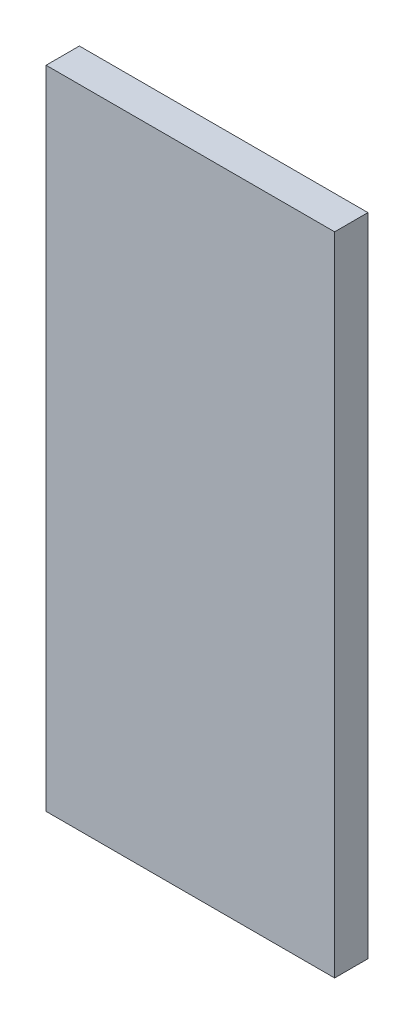
ISO-10303-21;
HEADER;
FILE_DESCRIPTION(('STEP AP214'),'2;1');
FILE_NAME('part.step','',(''),(''),'','','');
FILE_SCHEMA(('AUTOMOTIVE_DESIGN { 1 0 10303 214 1 1 1 1 }'));
ENDSEC;
DATA;
#1=APPLICATION_CONTEXT('core data for automotive mechanical design processes');
#2=APPLICATION_PROTOCOL_DEFINITION('international standard','automotive_design',2000,#1);
#3=PRODUCT_CONTEXT('',#1,'mechanical');
#4=PRODUCT('Part','Part','',(#3));
#5=PRODUCT_RELATED_PRODUCT_CATEGORY('part','',(#4));
#6=PRODUCT_DEFINITION_FORMATION('','',#4);
#7=PRODUCT_DEFINITION_CONTEXT('part definition',#1,'design');
#8=PRODUCT_DEFINITION('design','',#6,#7);
#9=PRODUCT_DEFINITION_SHAPE('','',#8);
#10=(LENGTH_UNIT() NAMED_UNIT(*) SI_UNIT(.MILLI.,.METRE.));
#11=(NAMED_UNIT(*) PLANE_ANGLE_UNIT() SI_UNIT($,.RADIAN.));
#12=(NAMED_UNIT(*) SI_UNIT($,.STERADIAN.) SOLID_ANGLE_UNIT());
#13=UNCERTAINTY_MEASURE_WITH_UNIT(LENGTH_MEASURE(1.E-05),#10,'distance_accuracy_value','');
#14=(GEOMETRIC_REPRESENTATION_CONTEXT(3) GLOBAL_UNCERTAINTY_ASSIGNED_CONTEXT((#13)) GLOBAL_UNIT_ASSIGNED_CONTEXT((#10,
#11,#12)) REPRESENTATION_CONTEXT('',''));
#15=CARTESIAN_POINT('',(0.,0.,0.));
#16=DIRECTION('',(0.,0.,1.));
#17=DIRECTION('',(1.,0.,0.));
#18=AXIS2_PLACEMENT_3D('',#15,#16,#17);
#19=CARTESIAN_POINT('',(63.9410911532323,13.,10.));
#20=DIRECTION('',(-1.,0.,0.));
#21=DIRECTION('',(0.,-1.,0.));
#22=AXIS2_PLACEMENT_3D('',#19,#20,#21);
#23=PLANE('',#22);
#24=DIRECTION('',(0.,1.,0.));
#25=VECTOR('',#24,1.);
#26=CARTESIAN_POINT('',(63.9410911532323,13.,0.));
#27=LINE('',#26,#25);
#28=CARTESIAN_POINT('',(63.9410911532323,-181.138919348291,0.));
#29=VERTEX_POINT('',#28);
#30=CARTESIAN_POINT('',(63.9410911532323,13.,0.));
#31=VERTEX_POINT('',#30);
#32=EDGE_CURVE('E100',#29,#31,#27,.T.);
#33=ORIENTED_EDGE('',*,*,#32,.T.);
#34=DIRECTION('',(0.,0.,-1.));
#35=VECTOR('',#34,1.);
#36=CARTESIAN_POINT('',(63.9410911532323,13.,10.));
#37=LINE('',#36,#35);
#38=CARTESIAN_POINT('',(63.9410911532323,13.,10.));
#39=VERTEX_POINT('',#38);
#40=EDGE_CURVE('E11',#39,#31,#37,.T.);
#41=ORIENTED_EDGE('',*,*,#40,.F.);
#42=DIRECTION('',(0.,1.,0.));
#43=VECTOR('',#42,1.);
#44=CARTESIAN_POINT('',(63.9410911532323,13.,10.));
#45=LINE('',#44,#43);
#46=CARTESIAN_POINT('',(63.9410911532323,-181.138919348291,10.));
#47=VERTEX_POINT('',#46);
#48=EDGE_CURVE('E88',#47,#39,#45,.T.);
#49=ORIENTED_EDGE('',*,*,#48,.F.);
#50=DIRECTION('',(0.,0.,-1.));
#51=VECTOR('',#50,1.);
#52=CARTESIAN_POINT('',(63.9410911532323,-181.138919348291,10.));
#53=LINE('',#52,#51);
#54=EDGE_CURVE('E96',#47,#29,#53,.T.);
#55=ORIENTED_EDGE('',*,*,#54,.T.);
#56=EDGE_LOOP('',(#33,#41,#49,#55));
#57=FACE_BOUND('',#56,.T.);
#58=ADVANCED_FACE('F37',(#57),#23,.F.);
#59=CARTESIAN_POINT('',(63.9410911532323,13.,10.));
#60=DIRECTION('',(0.,-1.,0.));
#61=DIRECTION('',(1.,0.,0.));
#62=AXIS2_PLACEMENT_3D('',#59,#60,#61);
#63=PLANE('',#62);
#64=DIRECTION('',(-1.,0.,0.));
#65=VECTOR('',#64,1.);
#66=CARTESIAN_POINT('',(63.9410911532323,13.,0.));
#67=LINE('',#66,#65);
#68=CARTESIAN_POINT('',(-22.7426420815675,13.,0.));
#69=VERTEX_POINT('',#68);
#70=EDGE_CURVE('E92',#31,#69,#67,.T.);
#71=ORIENTED_EDGE('',*,*,#70,.T.);
#72=DIRECTION('',(0.,0.,-1.));
#73=VECTOR('',#72,1.);
#74=CARTESIAN_POINT('',(-22.7426420815675,13.,10.));
#75=LINE('',#74,#73);
#76=CARTESIAN_POINT('',(-22.7426420815675,13.,10.));
#77=VERTEX_POINT('',#76);
#78=EDGE_CURVE('E45',#77,#69,#75,.T.);
#79=ORIENTED_EDGE('',*,*,#78,.F.);
#80=DIRECTION('',(-1.,0.,0.));
#81=VECTOR('',#80,1.);
#82=CARTESIAN_POINT('',(63.9410911532323,13.,10.));
#83=LINE('',#82,#81);
#84=EDGE_CURVE('E83',#39,#77,#83,.T.);
#85=ORIENTED_EDGE('',*,*,#84,.F.);
#86=ORIENTED_EDGE('',*,*,#40,.T.);
#87=EDGE_LOOP('',(#71,#79,#85,#86));
#88=FACE_BOUND('',#87,.T.);
#89=ADVANCED_FACE('F91',(#88),#63,.F.);
#90=CARTESIAN_POINT('',(-22.7426420815675,13.,10.));
#91=DIRECTION('',(1.,0.,0.));
#92=DIRECTION('',(0.,1.,0.));
#93=AXIS2_PLACEMENT_3D('',#90,#91,#92);
#94=PLANE('',#93);
#95=DIRECTION('',(0.,-1.,0.));
#96=VECTOR('',#95,1.);
#97=CARTESIAN_POINT('',(-22.7426420815675,13.,0.));
#98=LINE('',#97,#96);
#99=CARTESIAN_POINT('',(-22.7426420815675,-181.138919348291,0.));
#100=VERTEX_POINT('',#99);
#101=EDGE_CURVE('E70',#69,#100,#98,.T.);
#102=ORIENTED_EDGE('',*,*,#101,.T.);
#103=DIRECTION('',(0.,0.,-1.));
#104=VECTOR('',#103,1.);
#105=CARTESIAN_POINT('',(-22.7426420815675,-181.138919348291,10.));
#106=LINE('',#105,#104);
#107=CARTESIAN_POINT('',(-22.7426420815675,-181.138919348291,10.));
#108=VERTEX_POINT('',#107);
#109=EDGE_CURVE('E93',#108,#100,#106,.T.);
#110=ORIENTED_EDGE('',*,*,#109,.F.);
#111=DIRECTION('',(0.,-1.,0.));
#112=VECTOR('',#111,1.);
#113=CARTESIAN_POINT('',(-22.7426420815675,13.,10.));
#114=LINE('',#113,#112);
#115=EDGE_CURVE('E86',#77,#108,#114,.T.);
#116=ORIENTED_EDGE('',*,*,#115,.F.);
#117=ORIENTED_EDGE('',*,*,#78,.T.);
#118=EDGE_LOOP('',(#102,#110,#116,#117));
#119=FACE_BOUND('',#118,.T.);
#120=ADVANCED_FACE('F94',(#119),#94,.F.);
#121=CARTESIAN_POINT('',(63.9410911532323,-181.138919348291,10.));
#122=DIRECTION('',(0.,1.,0.));
#123=DIRECTION('',(-1.,0.,0.));
#124=AXIS2_PLACEMENT_3D('',#121,#122,#123);
#125=PLANE('',#124);
#126=DIRECTION('',(1.,0.,0.));
#127=VECTOR('',#126,1.);
#128=CARTESIAN_POINT('',(63.9410911532323,-181.138919348291,0.));
#129=LINE('',#128,#127);
#130=EDGE_CURVE('E76',#100,#29,#129,.T.);
#131=ORIENTED_EDGE('',*,*,#130,.T.);
#132=ORIENTED_EDGE('',*,*,#54,.F.);
#133=DIRECTION('',(1.,0.,0.));
#134=VECTOR('',#133,1.);
#135=CARTESIAN_POINT('',(63.9410911532323,-181.138919348291,10.));
#136=LINE('',#135,#134);
#137=EDGE_CURVE('E53',#108,#47,#136,.T.);
#138=ORIENTED_EDGE('',*,*,#137,.F.);
#139=ORIENTED_EDGE('',*,*,#109,.T.);
#140=EDGE_LOOP('',(#131,#132,#138,#139));
#141=FACE_BOUND('',#140,.T.);
#142=ADVANCED_FACE('F107',(#141),#125,.F.);
#143=CARTESIAN_POINT('',(0.,0.,10.));
#144=DIRECTION('',(0.,0.,-1.));
#145=DIRECTION('',(-1.,0.,0.));
#146=AXIS2_PLACEMENT_3D('',#143,#144,#145);
#147=PLANE('',#146);
#148=ORIENTED_EDGE('',*,*,#48,.T.);
#149=ORIENTED_EDGE('',*,*,#84,.T.);
#150=ORIENTED_EDGE('',*,*,#115,.T.);
#151=ORIENTED_EDGE('',*,*,#137,.T.);
#152=EDGE_LOOP('',(#148,#149,#150,#151));
#153=FACE_BOUND('',#152,.T.);
#154=ADVANCED_FACE('F84',(#153),#147,.F.);
#155=CARTESIAN_POINT('',(0.,0.,0.));
#156=DIRECTION('',(0.,0.,-1.));
#157=DIRECTION('',(-1.,0.,0.));
#158=AXIS2_PLACEMENT_3D('',#155,#156,#157);
#159=PLANE('',#158);
#160=ORIENTED_EDGE('',*,*,#32,.F.);
#161=ORIENTED_EDGE('',*,*,#130,.F.);
#162=ORIENTED_EDGE('',*,*,#101,.F.);
#163=ORIENTED_EDGE('',*,*,#70,.F.);
#164=EDGE_LOOP('',(#160,#161,#162,#163));
#165=FACE_BOUND('',#164,.T.);
#166=ADVANCED_FACE('F110',(#165),#159,.T.);
#167=CLOSED_SHELL('',(#58,#89,#120,#142,#154,#166));
#168=MANIFOLD_SOLID_BREP('B2',#167);
#169=ADVANCED_BREP_SHAPE_REPRESENTATION('',(#18,#168),#14);
#170=SHAPE_DEFINITION_REPRESENTATION(#9,#169);
ENDSEC;
END-ISO-10303-21;
